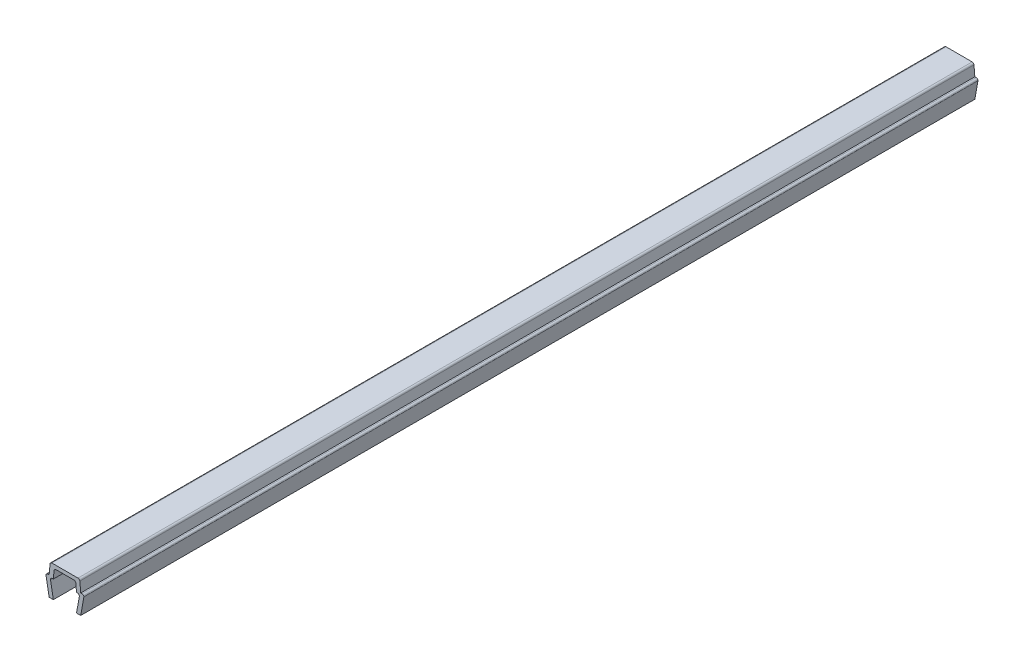
ISO-10303-21;
HEADER;
FILE_DESCRIPTION(('STEP AP214'),'2;1');
FILE_NAME('part.step','',(''),(''),'','','');
FILE_SCHEMA(('AUTOMOTIVE_DESIGN { 1 0 10303 214 1 1 1 1 }'));
ENDSEC;
DATA;
#1=APPLICATION_CONTEXT('core data for automotive mechanical design processes');
#2=APPLICATION_PROTOCOL_DEFINITION('international standard','automotive_design',2000,#1);
#3=PRODUCT_CONTEXT('',#1,'mechanical');
#4=PRODUCT('Part','Part','',(#3));
#5=PRODUCT_RELATED_PRODUCT_CATEGORY('part','',(#4));
#6=PRODUCT_DEFINITION_FORMATION('','',#4);
#7=PRODUCT_DEFINITION_CONTEXT('part definition',#1,'design');
#8=PRODUCT_DEFINITION('design','',#6,#7);
#9=PRODUCT_DEFINITION_SHAPE('','',#8);
#10=(LENGTH_UNIT() NAMED_UNIT(*) SI_UNIT(.MILLI.,.METRE.));
#11=(NAMED_UNIT(*) PLANE_ANGLE_UNIT() SI_UNIT($,.RADIAN.));
#12=(NAMED_UNIT(*) SI_UNIT($,.STERADIAN.) SOLID_ANGLE_UNIT());
#13=UNCERTAINTY_MEASURE_WITH_UNIT(LENGTH_MEASURE(1.E-05),#10,'distance_accuracy_value','');
#14=(GEOMETRIC_REPRESENTATION_CONTEXT(3) GLOBAL_UNCERTAINTY_ASSIGNED_CONTEXT((#13)) GLOBAL_UNIT_ASSIGNED_CONTEXT((#10,
#11,#12)) REPRESENTATION_CONTEXT('',''));
#15=CARTESIAN_POINT('',(0.,0.,0.));
#16=DIRECTION('',(0.,0.,1.));
#17=DIRECTION('',(1.,0.,0.));
#18=AXIS2_PLACEMENT_3D('',#15,#16,#17);
#19=CARTESIAN_POINT('',(-3.25000000000003,3.35000000000003,85.));
#20=DIRECTION('',(0.,0.,-1.));
#21=DIRECTION('',(-1.,0.,0.));
#22=AXIS2_PLACEMENT_3D('',#19,#20,#21);
#23=CYLINDRICAL_SURFACE('',#22,0.349999999999972);
#24=DIRECTION('',(0.,0.,-1.));
#25=VECTOR('',#24,1.);
#26=CARTESIAN_POINT('',(-3.25,3.7,85.));
#27=LINE('',#26,#25);
#28=CARTESIAN_POINT('',(-3.25,3.7,85.));
#29=VERTEX_POINT('',#28);
#30=CARTESIAN_POINT('',(-3.25,3.7,-85.));
#31=VERTEX_POINT('',#30);
#32=EDGE_CURVE('E211',#29,#31,#27,.T.);
#33=ORIENTED_EDGE('',*,*,#32,.T.);
#34=CARTESIAN_POINT('',(-3.25000000000003,3.35000000000003,-85.));
#35=DIRECTION('',(0.,0.,1.));
#36=DIRECTION('',(1.,0.,0.));
#37=AXIS2_PLACEMENT_3D('',#34,#35,#36);
#38=CIRCLE('',#37,0.349999999999972);
#39=CARTESIAN_POINT('',(-3.6,3.35,-85.));
#40=VERTEX_POINT('',#39);
#41=EDGE_CURVE('E205',#31,#40,#38,.T.);
#42=ORIENTED_EDGE('',*,*,#41,.T.);
#43=DIRECTION('',(0.,0.,-1.));
#44=VECTOR('',#43,1.);
#45=CARTESIAN_POINT('',(-3.6,3.35,85.));
#46=LINE('',#45,#44);
#47=CARTESIAN_POINT('',(-3.6,3.35,85.));
#48=VERTEX_POINT('',#47);
#49=EDGE_CURVE('E11',#48,#40,#46,.T.);
#50=ORIENTED_EDGE('',*,*,#49,.F.);
#51=CARTESIAN_POINT('',(-3.25000000000003,3.35000000000003,85.));
#52=DIRECTION('',(0.,0.,1.));
#53=DIRECTION('',(1.,0.,0.));
#54=AXIS2_PLACEMENT_3D('',#51,#52,#53);
#55=CIRCLE('',#54,0.349999999999972);
#56=EDGE_CURVE('E277',#29,#48,#55,.T.);
#57=ORIENTED_EDGE('',*,*,#56,.F.);
#58=EDGE_LOOP('',(#33,#42,#50,#57));
#59=FACE_BOUND('',#58,.T.);
#60=ADVANCED_FACE('F33',(#59),#23,.T.);
#61=CARTESIAN_POINT('',(-3.6,3.35,85.));
#62=DIRECTION('',(0.984336643247304,0.176299100283099,0.));
#63=DIRECTION('',(-0.176299100283099,0.984336643247304,0.));
#64=AXIS2_PLACEMENT_3D('',#61,#62,#63);
#65=PLANE('',#64);
#66=ORIENTED_EDGE('',*,*,#49,.T.);
#67=DIRECTION('',(0.176299100283099,-0.984336643247304,0.));
#68=VECTOR('',#67,1.);
#69=CARTESIAN_POINT('',(-3.6,3.35,-85.));
#70=LINE('',#69,#68);
#71=CARTESIAN_POINT('',(-3.,0.,-85.));
#72=VERTEX_POINT('',#71);
#73=EDGE_CURVE('E195',#40,#72,#70,.T.);
#74=ORIENTED_EDGE('',*,*,#73,.T.);
#75=DIRECTION('',(0.,0.,-1.));
#76=VECTOR('',#75,1.);
#77=CARTESIAN_POINT('',(-3.,0.,85.));
#78=LINE('',#77,#76);
#79=CARTESIAN_POINT('',(-3.,0.,85.));
#80=VERTEX_POINT('',#79);
#81=EDGE_CURVE('E40',#80,#72,#78,.T.);
#82=ORIENTED_EDGE('',*,*,#81,.F.);
#83=DIRECTION('',(0.176299100283099,-0.984336643247304,0.));
#84=VECTOR('',#83,1.);
#85=CARTESIAN_POINT('',(-3.6,3.35,85.));
#86=LINE('',#85,#84);
#87=EDGE_CURVE('E196',#48,#80,#86,.T.);
#88=ORIENTED_EDGE('',*,*,#87,.F.);
#89=EDGE_LOOP('',(#66,#74,#82,#88));
#90=FACE_BOUND('',#89,.T.);
#91=ADVANCED_FACE('F193',(#90),#65,.F.);
#92=CARTESIAN_POINT('',(-3.,0.,85.));
#93=DIRECTION('',(0.,1.,0.));
#94=DIRECTION('',(0.,0.,1.));
#95=AXIS2_PLACEMENT_3D('',#92,#93,#94);
#96=PLANE('',#95);
#97=ORIENTED_EDGE('',*,*,#81,.T.);
#98=DIRECTION('',(1.,0.,0.));
#99=VECTOR('',#98,1.);
#100=CARTESIAN_POINT('',(-3.,0.,-85.));
#101=LINE('',#100,#99);
#102=CARTESIAN_POINT('',(-2.2,0.,-85.));
#103=VERTEX_POINT('',#102);
#104=EDGE_CURVE('E209',#72,#103,#101,.T.);
#105=ORIENTED_EDGE('',*,*,#104,.T.);
#106=DIRECTION('',(0.,0.,-1.));
#107=VECTOR('',#106,1.);
#108=CARTESIAN_POINT('',(-2.2,0.,85.));
#109=LINE('',#108,#107);
#110=CARTESIAN_POINT('',(-2.2,0.,85.));
#111=VERTEX_POINT('',#110);
#112=EDGE_CURVE('E363',#111,#103,#109,.T.);
#113=ORIENTED_EDGE('',*,*,#112,.F.);
#114=DIRECTION('',(1.,0.,0.));
#115=VECTOR('',#114,1.);
#116=CARTESIAN_POINT('',(-3.,0.,85.));
#117=LINE('',#116,#115);
#118=EDGE_CURVE('E280',#80,#111,#117,.T.);
#119=ORIENTED_EDGE('',*,*,#118,.F.);
#120=EDGE_LOOP('',(#97,#105,#113,#119));
#121=FACE_BOUND('',#120,.T.);
#122=ADVANCED_FACE('F366',(#121),#96,.F.);
#123=CARTESIAN_POINT('',(-2.2,0.,85.));
#124=DIRECTION('',(-0.984336643247306,-0.176299100283088,0.));
#125=DIRECTION('',(0.176299100283088,-0.984336643247306,0.));
#126=AXIS2_PLACEMENT_3D('',#123,#124,#125);
#127=PLANE('',#126);
#128=ORIENTED_EDGE('',*,*,#112,.T.);
#129=DIRECTION('',(-0.176299100283088,0.984336643247306,0.));
#130=VECTOR('',#129,1.);
#131=CARTESIAN_POINT('',(-2.2,0.,-85.));
#132=LINE('',#131,#130);
#133=CARTESIAN_POINT('',(-2.7352170713255,2.9882953149009,-85.));
#134=VERTEX_POINT('',#133);
#135=EDGE_CURVE('E215',#103,#134,#132,.T.);
#136=ORIENTED_EDGE('',*,*,#135,.T.);
#137=DIRECTION('',(0.,0.,-1.));
#138=VECTOR('',#137,1.);
#139=CARTESIAN_POINT('',(-2.7352170713255,2.9882953149009,85.));
#140=LINE('',#139,#138);
#141=CARTESIAN_POINT('',(-2.7352170713255,2.9882953149009,85.));
#142=VERTEX_POINT('',#141);
#143=EDGE_CURVE('E361',#142,#134,#140,.T.);
#144=ORIENTED_EDGE('',*,*,#143,.F.);
#145=DIRECTION('',(-0.176299100283088,0.984336643247306,0.));
#146=VECTOR('',#145,1.);
#147=CARTESIAN_POINT('',(-2.2,0.,85.));
#148=LINE('',#147,#146);
#149=EDGE_CURVE('E282',#111,#142,#148,.T.);
#150=ORIENTED_EDGE('',*,*,#149,.F.);
#151=EDGE_LOOP('',(#128,#136,#144,#150));
#152=FACE_BOUND('',#151,.T.);
#153=ADVANCED_FACE('F374',(#152),#127,.F.);
#154=CARTESIAN_POINT('',(-2.390699246189,3.05000000000004,85.));
#155=DIRECTION('',(0.,0.,-1.));
#156=DIRECTION('',(-1.,0.,0.));
#157=AXIS2_PLACEMENT_3D('',#154,#155,#156);
#158=CYLINDRICAL_SURFACE('',#157,0.349999999999955);
#159=ORIENTED_EDGE('',*,*,#143,.T.);
#160=CARTESIAN_POINT('',(-2.390699246189,3.05000000000004,-85.));
#161=DIRECTION('',(0.,0.,-1.));
#162=DIRECTION('',(-1.,0.,0.));
#163=AXIS2_PLACEMENT_3D('',#160,#161,#162);
#164=CIRCLE('',#163,0.349999999999955);
#165=CARTESIAN_POINT('',(-2.390699246189,3.4,-85.));
#166=VERTEX_POINT('',#165);
#167=EDGE_CURVE('E218',#134,#166,#164,.T.);
#168=ORIENTED_EDGE('',*,*,#167,.T.);
#169=DIRECTION('',(0.,0.,-1.));
#170=VECTOR('',#169,1.);
#171=CARTESIAN_POINT('',(-2.390699246189,3.4,85.));
#172=LINE('',#171,#170);
#173=CARTESIAN_POINT('',(-2.390699246189,3.4,85.));
#174=VERTEX_POINT('',#173);
#175=EDGE_CURVE('E359',#174,#166,#172,.T.);
#176=ORIENTED_EDGE('',*,*,#175,.F.);
#177=CARTESIAN_POINT('',(-2.390699246189,3.05000000000004,85.));
#178=DIRECTION('',(0.,0.,-1.));
#179=DIRECTION('',(-1.,0.,0.));
#180=AXIS2_PLACEMENT_3D('',#177,#178,#179);
#181=CIRCLE('',#180,0.349999999999955);
#182=EDGE_CURVE('E284',#142,#174,#181,.T.);
#183=ORIENTED_EDGE('',*,*,#182,.F.);
#184=EDGE_LOOP('',(#159,#168,#176,#183));
#185=FACE_BOUND('',#184,.T.);
#186=ADVANCED_FACE('F377',(#185),#158,.F.);
#187=CARTESIAN_POINT('',(-2.390699246189,3.4,85.));
#188=DIRECTION('',(0.,1.,0.));
#189=DIRECTION('',(0.,0.,1.));
#190=AXIS2_PLACEMENT_3D('',#187,#188,#189);
#191=PLANE('',#190);
#192=ORIENTED_EDGE('',*,*,#175,.T.);
#193=DIRECTION('',(1.,0.,0.));
#194=VECTOR('',#193,1.);
#195=CARTESIAN_POINT('',(-2.390699246189,3.4,-85.));
#196=LINE('',#195,#194);
#197=CARTESIAN_POINT('',(-2.2,3.4,-85.));
#198=VERTEX_POINT('',#197);
#199=EDGE_CURVE('E221',#166,#198,#196,.T.);
#200=ORIENTED_EDGE('',*,*,#199,.T.);
#201=DIRECTION('',(0.,0.,-1.));
#202=VECTOR('',#201,1.);
#203=CARTESIAN_POINT('',(-2.2,3.4,85.));
#204=LINE('',#203,#202);
#205=CARTESIAN_POINT('',(-2.2,3.4,85.));
#206=VERTEX_POINT('',#205);
#207=EDGE_CURVE('E357',#206,#198,#204,.T.);
#208=ORIENTED_EDGE('',*,*,#207,.F.);
#209=DIRECTION('',(1.,0.,0.));
#210=VECTOR('',#209,1.);
#211=CARTESIAN_POINT('',(-2.390699246189,3.4,85.));
#212=LINE('',#211,#210);
#213=EDGE_CURVE('E286',#174,#206,#212,.T.);
#214=ORIENTED_EDGE('',*,*,#213,.F.);
#215=EDGE_LOOP('',(#192,#200,#208,#214));
#216=FACE_BOUND('',#215,.T.);
#217=ADVANCED_FACE('F382',(#216),#191,.F.);
#218=CARTESIAN_POINT('',(-2.2,3.4,85.));
#219=DIRECTION('',(-0.996194698091743,0.08715574274769,0.));
#220=DIRECTION('',(-0.08715574274769,-0.996194698091743,0.));
#221=AXIS2_PLACEMENT_3D('',#218,#219,#220);
#222=PLANE('',#221);
#223=ORIENTED_EDGE('',*,*,#207,.T.);
#224=DIRECTION('',(0.08715574274769,0.996194698091743,0.));
#225=VECTOR('',#224,1.);
#226=CARTESIAN_POINT('',(-2.2,3.4,-85.));
#227=LINE('',#226,#225);
#228=CARTESIAN_POINT('',(-2.0704726390793,4.8805045099617,-85.));
#229=VERTEX_POINT('',#228);
#230=EDGE_CURVE('E224',#198,#229,#227,.T.);
#231=ORIENTED_EDGE('',*,*,#230,.T.);
#232=DIRECTION('',(0.,0.,-1.));
#233=VECTOR('',#232,1.);
#234=CARTESIAN_POINT('',(-2.0704726390793,4.8805045099617,85.));
#235=LINE('',#234,#233);
#236=CARTESIAN_POINT('',(-2.0704726390793,4.8805045099617,85.));
#237=VERTEX_POINT('',#236);
#238=EDGE_CURVE('E355',#237,#229,#235,.T.);
#239=ORIENTED_EDGE('',*,*,#238,.F.);
#240=DIRECTION('',(0.08715574274769,0.996194698091743,0.));
#241=VECTOR('',#240,1.);
#242=CARTESIAN_POINT('',(-2.2,3.4,85.));
#243=LINE('',#242,#241);
#244=EDGE_CURVE('E288',#206,#237,#243,.T.);
#245=ORIENTED_EDGE('',*,*,#244,.F.);
#246=EDGE_LOOP('',(#223,#231,#239,#245));
#247=FACE_BOUND('',#246,.T.);
#248=ADVANCED_FACE('F388',(#247),#222,.F.);
#249=CARTESIAN_POINT('',(-1.72180449474716,4.84999999999996,85.));
#250=DIRECTION('',(0.,0.,-1.));
#251=DIRECTION('',(-1.,0.,0.));
#252=AXIS2_PLACEMENT_3D('',#249,#250,#251);
#253=CYLINDRICAL_SURFACE('',#252,0.350000000000036);
#254=ORIENTED_EDGE('',*,*,#238,.T.);
#255=CARTESIAN_POINT('',(-1.72180449474716,4.84999999999996,-85.));
#256=DIRECTION('',(0.,0.,-1.));
#257=DIRECTION('',(-1.,0.,0.));
#258=AXIS2_PLACEMENT_3D('',#255,#256,#257);
#259=CIRCLE('',#258,0.350000000000036);
#260=CARTESIAN_POINT('',(-1.7218044947472,5.2,-85.));
#261=VERTEX_POINT('',#260);
#262=EDGE_CURVE('E227',#229,#261,#259,.T.);
#263=ORIENTED_EDGE('',*,*,#262,.T.);
#264=DIRECTION('',(0.,0.,-1.));
#265=VECTOR('',#264,1.);
#266=CARTESIAN_POINT('',(-1.7218044947472,5.2,85.));
#267=LINE('',#266,#265);
#268=CARTESIAN_POINT('',(-1.7218044947472,5.2,85.));
#269=VERTEX_POINT('',#268);
#270=EDGE_CURVE('E353',#269,#261,#267,.T.);
#271=ORIENTED_EDGE('',*,*,#270,.F.);
#272=CARTESIAN_POINT('',(-1.72180449474716,4.84999999999996,85.));
#273=DIRECTION('',(0.,0.,-1.));
#274=DIRECTION('',(-1.,0.,0.));
#275=AXIS2_PLACEMENT_3D('',#272,#273,#274);
#276=CIRCLE('',#275,0.350000000000036);
#277=EDGE_CURVE('E290',#237,#269,#276,.T.);
#278=ORIENTED_EDGE('',*,*,#277,.F.);
#279=EDGE_LOOP('',(#254,#263,#271,#278));
#280=FACE_BOUND('',#279,.T.);
#281=ADVANCED_FACE('F392',(#280),#253,.F.);
#282=CARTESIAN_POINT('',(-1.7218044947472,5.2,85.));
#283=DIRECTION('',(0.,1.,0.));
#284=DIRECTION('',(0.,0.,1.));
#285=AXIS2_PLACEMENT_3D('',#282,#283,#284);
#286=PLANE('',#285);
#287=ORIENTED_EDGE('',*,*,#270,.T.);
#288=DIRECTION('',(1.,0.,0.));
#289=VECTOR('',#288,1.);
#290=CARTESIAN_POINT('',(-1.7218044947472,5.2,-85.));
#291=LINE('',#290,#289);
#292=CARTESIAN_POINT('',(1.7218044947472,5.2,-85.));
#293=VERTEX_POINT('',#292);
#294=EDGE_CURVE('E230',#261,#293,#291,.T.);
#295=ORIENTED_EDGE('',*,*,#294,.T.);
#296=DIRECTION('',(0.,0.,-1.));
#297=VECTOR('',#296,1.);
#298=CARTESIAN_POINT('',(1.7218044947472,5.2,85.));
#299=LINE('',#298,#297);
#300=CARTESIAN_POINT('',(1.7218044947472,5.2,85.));
#301=VERTEX_POINT('',#300);
#302=EDGE_CURVE('E351',#301,#293,#299,.T.);
#303=ORIENTED_EDGE('',*,*,#302,.F.);
#304=DIRECTION('',(1.,0.,0.));
#305=VECTOR('',#304,1.);
#306=CARTESIAN_POINT('',(-1.7218044947472,5.2,85.));
#307=LINE('',#306,#305);
#308=EDGE_CURVE('E292',#269,#301,#307,.T.);
#309=ORIENTED_EDGE('',*,*,#308,.F.);
#310=EDGE_LOOP('',(#287,#295,#303,#309));
#311=FACE_BOUND('',#310,.T.);
#312=ADVANCED_FACE('F397',(#311),#286,.F.);
#313=CARTESIAN_POINT('',(1.72180449474716,4.84999999999996,85.));
#314=DIRECTION('',(0.,0.,-1.));
#315=DIRECTION('',(-1.,0.,0.));
#316=AXIS2_PLACEMENT_3D('',#313,#314,#315);
#317=CYLINDRICAL_SURFACE('',#316,0.350000000000036);
#318=ORIENTED_EDGE('',*,*,#302,.T.);
#319=CARTESIAN_POINT('',(1.72180449474716,4.84999999999996,-85.));
#320=DIRECTION('',(0.,0.,-1.));
#321=DIRECTION('',(-1.,0.,0.));
#322=AXIS2_PLACEMENT_3D('',#319,#320,#321);
#323=CIRCLE('',#322,0.350000000000036);
#324=CARTESIAN_POINT('',(2.0704726390793,4.8805045099617,-85.));
#325=VERTEX_POINT('',#324);
#326=EDGE_CURVE('E233',#293,#325,#323,.T.);
#327=ORIENTED_EDGE('',*,*,#326,.T.);
#328=DIRECTION('',(0.,0.,-1.));
#329=VECTOR('',#328,1.);
#330=CARTESIAN_POINT('',(2.0704726390793,4.8805045099617,85.));
#331=LINE('',#330,#329);
#332=CARTESIAN_POINT('',(2.0704726390793,4.8805045099617,85.));
#333=VERTEX_POINT('',#332);
#334=EDGE_CURVE('E349',#333,#325,#331,.T.);
#335=ORIENTED_EDGE('',*,*,#334,.F.);
#336=CARTESIAN_POINT('',(1.72180449474716,4.84999999999996,85.));
#337=DIRECTION('',(0.,0.,-1.));
#338=DIRECTION('',(-1.,0.,0.));
#339=AXIS2_PLACEMENT_3D('',#336,#337,#338);
#340=CIRCLE('',#339,0.350000000000036);
#341=EDGE_CURVE('E294',#301,#333,#340,.T.);
#342=ORIENTED_EDGE('',*,*,#341,.F.);
#343=EDGE_LOOP('',(#318,#327,#335,#342));
#344=FACE_BOUND('',#343,.T.);
#345=ADVANCED_FACE('F403',(#344),#317,.F.);
#346=CARTESIAN_POINT('',(2.0704726390793,4.8805045099617,85.));
#347=DIRECTION('',(0.996194698091743,0.08715574274769,0.));
#348=DIRECTION('',(-0.08715574274769,0.996194698091743,0.));
#349=AXIS2_PLACEMENT_3D('',#346,#347,#348);
#350=PLANE('',#349);
#351=ORIENTED_EDGE('',*,*,#334,.T.);
#352=DIRECTION('',(0.08715574274769,-0.996194698091743,0.));
#353=VECTOR('',#352,1.);
#354=CARTESIAN_POINT('',(2.0704726390793,4.8805045099617,-85.));
#355=LINE('',#354,#353);
#356=CARTESIAN_POINT('',(2.2,3.4,-85.));
#357=VERTEX_POINT('',#356);
#358=EDGE_CURVE('E236',#325,#357,#355,.T.);
#359=ORIENTED_EDGE('',*,*,#358,.T.);
#360=DIRECTION('',(0.,0.,-1.));
#361=VECTOR('',#360,1.);
#362=CARTESIAN_POINT('',(2.2,3.4,85.));
#363=LINE('',#362,#361);
#364=CARTESIAN_POINT('',(2.2,3.4,85.));
#365=VERTEX_POINT('',#364);
#366=EDGE_CURVE('E347',#365,#357,#363,.T.);
#367=ORIENTED_EDGE('',*,*,#366,.F.);
#368=DIRECTION('',(0.08715574274769,-0.996194698091743,0.));
#369=VECTOR('',#368,1.);
#370=CARTESIAN_POINT('',(2.0704726390793,4.8805045099617,85.));
#371=LINE('',#370,#369);
#372=EDGE_CURVE('E296',#333,#365,#371,.T.);
#373=ORIENTED_EDGE('',*,*,#372,.F.);
#374=EDGE_LOOP('',(#351,#359,#367,#373));
#375=FACE_BOUND('',#374,.T.);
#376=ADVANCED_FACE('F407',(#375),#350,.F.);
#377=CARTESIAN_POINT('',(2.2,3.4,85.));
#378=DIRECTION('',(0.,1.,0.));
#379=DIRECTION('',(0.,0.,1.));
#380=AXIS2_PLACEMENT_3D('',#377,#378,#379);
#381=PLANE('',#380);
#382=ORIENTED_EDGE('',*,*,#366,.T.);
#383=DIRECTION('',(1.,0.,0.));
#384=VECTOR('',#383,1.);
#385=CARTESIAN_POINT('',(2.2,3.4,-85.));
#386=LINE('',#385,#384);
#387=CARTESIAN_POINT('',(2.390699246189,3.4,-85.));
#388=VERTEX_POINT('',#387);
#389=EDGE_CURVE('E239',#357,#388,#386,.T.);
#390=ORIENTED_EDGE('',*,*,#389,.T.);
#391=DIRECTION('',(0.,0.,-1.));
#392=VECTOR('',#391,1.);
#393=CARTESIAN_POINT('',(2.390699246189,3.4,85.));
#394=LINE('',#393,#392);
#395=CARTESIAN_POINT('',(2.390699246189,3.4,85.));
#396=VERTEX_POINT('',#395);
#397=EDGE_CURVE('E345',#396,#388,#394,.T.);
#398=ORIENTED_EDGE('',*,*,#397,.F.);
#399=DIRECTION('',(1.,0.,0.));
#400=VECTOR('',#399,1.);
#401=CARTESIAN_POINT('',(2.2,3.4,85.));
#402=LINE('',#401,#400);
#403=EDGE_CURVE('E298',#365,#396,#402,.T.);
#404=ORIENTED_EDGE('',*,*,#403,.F.);
#405=EDGE_LOOP('',(#382,#390,#398,#404));
#406=FACE_BOUND('',#405,.T.);
#407=ADVANCED_FACE('F412',(#406),#381,.F.);
#408=CARTESIAN_POINT('',(2.390699246189,3.05000000000004,85.));
#409=DIRECTION('',(0.,0.,-1.));
#410=DIRECTION('',(-1.,0.,0.));
#411=AXIS2_PLACEMENT_3D('',#408,#409,#410);
#412=CYLINDRICAL_SURFACE('',#411,0.349999999999955);
#413=ORIENTED_EDGE('',*,*,#397,.T.);
#414=CARTESIAN_POINT('',(2.390699246189,3.05000000000004,-85.));
#415=DIRECTION('',(0.,0.,-1.));
#416=DIRECTION('',(-1.,0.,0.));
#417=AXIS2_PLACEMENT_3D('',#414,#415,#416);
#418=CIRCLE('',#417,0.349999999999955);
#419=CARTESIAN_POINT('',(2.7352170713255,2.9882953149009,-85.));
#420=VERTEX_POINT('',#419);
#421=EDGE_CURVE('E242',#388,#420,#418,.T.);
#422=ORIENTED_EDGE('',*,*,#421,.T.);
#423=DIRECTION('',(0.,0.,-1.));
#424=VECTOR('',#423,1.);
#425=CARTESIAN_POINT('',(2.7352170713255,2.9882953149009,85.));
#426=LINE('',#425,#424);
#427=CARTESIAN_POINT('',(2.7352170713255,2.9882953149009,85.));
#428=VERTEX_POINT('',#427);
#429=EDGE_CURVE('E343',#428,#420,#426,.T.);
#430=ORIENTED_EDGE('',*,*,#429,.F.);
#431=CARTESIAN_POINT('',(2.390699246189,3.05000000000004,85.));
#432=DIRECTION('',(0.,0.,-1.));
#433=DIRECTION('',(-1.,0.,0.));
#434=AXIS2_PLACEMENT_3D('',#431,#432,#433);
#435=CIRCLE('',#434,0.349999999999955);
#436=EDGE_CURVE('E300',#396,#428,#435,.T.);
#437=ORIENTED_EDGE('',*,*,#436,.F.);
#438=EDGE_LOOP('',(#413,#422,#430,#437));
#439=FACE_BOUND('',#438,.T.);
#440=ADVANCED_FACE('F418',(#439),#412,.F.);
#441=CARTESIAN_POINT('',(2.7352170713255,2.9882953149009,85.));
#442=DIRECTION('',(0.984336643247306,-0.176299100283088,0.));
#443=DIRECTION('',(0.176299100283088,0.984336643247306,0.));
#444=AXIS2_PLACEMENT_3D('',#441,#442,#443);
#445=PLANE('',#444);
#446=ORIENTED_EDGE('',*,*,#429,.T.);
#447=DIRECTION('',(-0.176299100283088,-0.984336643247306,0.));
#448=VECTOR('',#447,1.);
#449=CARTESIAN_POINT('',(2.7352170713255,2.9882953149009,-85.));
#450=LINE('',#449,#448);
#451=CARTESIAN_POINT('',(2.2,0.,-85.));
#452=VERTEX_POINT('',#451);
#453=EDGE_CURVE('E245',#420,#452,#450,.T.);
#454=ORIENTED_EDGE('',*,*,#453,.T.);
#455=DIRECTION('',(0.,0.,-1.));
#456=VECTOR('',#455,1.);
#457=CARTESIAN_POINT('',(2.2,0.,85.));
#458=LINE('',#457,#456);
#459=CARTESIAN_POINT('',(2.2,0.,85.));
#460=VERTEX_POINT('',#459);
#461=EDGE_CURVE('E341',#460,#452,#458,.T.);
#462=ORIENTED_EDGE('',*,*,#461,.F.);
#463=DIRECTION('',(-0.176299100283088,-0.984336643247306,0.));
#464=VECTOR('',#463,1.);
#465=CARTESIAN_POINT('',(2.7352170713255,2.9882953149009,85.));
#466=LINE('',#465,#464);
#467=EDGE_CURVE('E302',#428,#460,#466,.T.);
#468=ORIENTED_EDGE('',*,*,#467,.F.);
#469=EDGE_LOOP('',(#446,#454,#462,#468));
#470=FACE_BOUND('',#469,.T.);
#471=ADVANCED_FACE('F422',(#470),#445,.F.);
#472=CARTESIAN_POINT('',(2.2,0.,85.));
#473=DIRECTION('',(0.,1.,0.));
#474=DIRECTION('',(0.,0.,1.));
#475=AXIS2_PLACEMENT_3D('',#472,#473,#474);
#476=PLANE('',#475);
#477=ORIENTED_EDGE('',*,*,#461,.T.);
#478=DIRECTION('',(1.,0.,0.));
#479=VECTOR('',#478,1.);
#480=CARTESIAN_POINT('',(2.2,0.,-85.));
#481=LINE('',#480,#479);
#482=CARTESIAN_POINT('',(3.,0.,-85.));
#483=VERTEX_POINT('',#482);
#484=EDGE_CURVE('E248',#452,#483,#481,.T.);
#485=ORIENTED_EDGE('',*,*,#484,.T.);
#486=DIRECTION('',(0.,0.,-1.));
#487=VECTOR('',#486,1.);
#488=CARTESIAN_POINT('',(3.,0.,85.));
#489=LINE('',#488,#487);
#490=CARTESIAN_POINT('',(3.,0.,85.));
#491=VERTEX_POINT('',#490);
#492=EDGE_CURVE('E339',#491,#483,#489,.T.);
#493=ORIENTED_EDGE('',*,*,#492,.F.);
#494=DIRECTION('',(1.,0.,0.));
#495=VECTOR('',#494,1.);
#496=CARTESIAN_POINT('',(2.2,0.,85.));
#497=LINE('',#496,#495);
#498=EDGE_CURVE('E304',#460,#491,#497,.T.);
#499=ORIENTED_EDGE('',*,*,#498,.F.);
#500=EDGE_LOOP('',(#477,#485,#493,#499));
#501=FACE_BOUND('',#500,.T.);
#502=ADVANCED_FACE('F427',(#501),#476,.F.);
#503=CARTESIAN_POINT('',(3.,0.,85.));
#504=DIRECTION('',(-0.984336643247304,0.176299100283099,0.));
#505=DIRECTION('',(-0.176299100283099,-0.984336643247304,0.));
#506=AXIS2_PLACEMENT_3D('',#503,#504,#505);
#507=PLANE('',#506);
#508=ORIENTED_EDGE('',*,*,#492,.T.);
#509=DIRECTION('',(0.176299100283099,0.984336643247304,0.));
#510=VECTOR('',#509,1.);
#511=CARTESIAN_POINT('',(3.,0.,-85.));
#512=LINE('',#511,#510);
#513=CARTESIAN_POINT('',(3.6,3.35,-85.));
#514=VERTEX_POINT('',#513);
#515=EDGE_CURVE('E251',#483,#514,#512,.T.);
#516=ORIENTED_EDGE('',*,*,#515,.T.);
#517=DIRECTION('',(0.,0.,-1.));
#518=VECTOR('',#517,1.);
#519=CARTESIAN_POINT('',(3.6,3.35,85.));
#520=LINE('',#519,#518);
#521=CARTESIAN_POINT('',(3.6,3.35,85.));
#522=VERTEX_POINT('',#521);
#523=EDGE_CURVE('E337',#522,#514,#520,.T.);
#524=ORIENTED_EDGE('',*,*,#523,.F.);
#525=DIRECTION('',(0.176299100283099,0.984336643247304,0.));
#526=VECTOR('',#525,1.);
#527=CARTESIAN_POINT('',(3.,0.,85.));
#528=LINE('',#527,#526);
#529=EDGE_CURVE('E306',#491,#522,#528,.T.);
#530=ORIENTED_EDGE('',*,*,#529,.F.);
#531=EDGE_LOOP('',(#508,#516,#524,#530));
#532=FACE_BOUND('',#531,.T.);
#533=ADVANCED_FACE('F433',(#532),#507,.F.);
#534=CARTESIAN_POINT('',(3.25000000000003,3.35000000000003,85.));
#535=DIRECTION('',(0.,0.,-1.));
#536=DIRECTION('',(-1.,0.,0.));
#537=AXIS2_PLACEMENT_3D('',#534,#535,#536);
#538=CYLINDRICAL_SURFACE('',#537,0.349999999999972);
#539=ORIENTED_EDGE('',*,*,#523,.T.);
#540=CARTESIAN_POINT('',(3.25000000000003,3.35000000000003,-85.));
#541=DIRECTION('',(0.,0.,1.));
#542=DIRECTION('',(1.,0.,0.));
#543=AXIS2_PLACEMENT_3D('',#540,#541,#542);
#544=CIRCLE('',#543,0.349999999999972);
#545=CARTESIAN_POINT('',(3.25,3.7,-85.));
#546=VERTEX_POINT('',#545);
#547=EDGE_CURVE('E254',#514,#546,#544,.T.);
#548=ORIENTED_EDGE('',*,*,#547,.T.);
#549=DIRECTION('',(0.,0.,-1.));
#550=VECTOR('',#549,1.);
#551=CARTESIAN_POINT('',(3.25,3.7,85.));
#552=LINE('',#551,#550);
#553=CARTESIAN_POINT('',(3.25,3.7,85.));
#554=VERTEX_POINT('',#553);
#555=EDGE_CURVE('E335',#554,#546,#552,.T.);
#556=ORIENTED_EDGE('',*,*,#555,.F.);
#557=CARTESIAN_POINT('',(3.25000000000003,3.35000000000003,85.));
#558=DIRECTION('',(0.,0.,1.));
#559=DIRECTION('',(1.,0.,0.));
#560=AXIS2_PLACEMENT_3D('',#557,#558,#559);
#561=CIRCLE('',#560,0.349999999999972);
#562=EDGE_CURVE('E308',#522,#554,#561,.T.);
#563=ORIENTED_EDGE('',*,*,#562,.F.);
#564=EDGE_LOOP('',(#539,#548,#556,#563));
#565=FACE_BOUND('',#564,.T.);
#566=ADVANCED_FACE('F437',(#565),#538,.T.);
#567=CARTESIAN_POINT('',(3.25,3.7,85.));
#568=DIRECTION('',(0.,-1.,0.));
#569=DIRECTION('',(0.,0.,-1.));
#570=AXIS2_PLACEMENT_3D('',#567,#568,#569);
#571=PLANE('',#570);
#572=ORIENTED_EDGE('',*,*,#555,.T.);
#573=DIRECTION('',(-1.,0.,0.));
#574=VECTOR('',#573,1.);
#575=CARTESIAN_POINT('',(3.25,3.7,-85.));
#576=LINE('',#575,#574);
#577=CARTESIAN_POINT('',(3.,3.7,-85.));
#578=VERTEX_POINT('',#577);
#579=EDGE_CURVE('E257',#546,#578,#576,.T.);
#580=ORIENTED_EDGE('',*,*,#579,.T.);
#581=DIRECTION('',(0.,0.,-1.));
#582=VECTOR('',#581,1.);
#583=CARTESIAN_POINT('',(3.,3.7,85.));
#584=LINE('',#583,#582);
#585=CARTESIAN_POINT('',(3.,3.7,85.));
#586=VERTEX_POINT('',#585);
#587=EDGE_CURVE('E333',#586,#578,#584,.T.);
#588=ORIENTED_EDGE('',*,*,#587,.F.);
#589=DIRECTION('',(-1.,0.,0.));
#590=VECTOR('',#589,1.);
#591=CARTESIAN_POINT('',(3.25,3.7,85.));
#592=LINE('',#591,#590);
#593=EDGE_CURVE('E310',#554,#586,#592,.T.);
#594=ORIENTED_EDGE('',*,*,#593,.F.);
#595=EDGE_LOOP('',(#572,#580,#588,#594));
#596=FACE_BOUND('',#595,.T.);
#597=ADVANCED_FACE('F442',(#596),#571,.F.);
#598=CARTESIAN_POINT('',(3.,3.7,85.));
#599=DIRECTION('',(-0.996194698091747,-0.0871557427476467,0.));
#600=DIRECTION('',(0.0871557427476467,-0.996194698091747,0.));
#601=AXIS2_PLACEMENT_3D('',#598,#599,#600);
#602=PLANE('',#601);
#603=ORIENTED_EDGE('',*,*,#587,.T.);
#604=DIRECTION('',(-0.0871557427476467,0.996194698091747,0.));
#605=VECTOR('',#604,1.);
#606=CARTESIAN_POINT('',(3.,3.7,-85.));
#607=LINE('',#606,#605);
#608=CARTESIAN_POINT('',(2.835477173669,5.5805045099617,-85.));
#609=VERTEX_POINT('',#608);
#610=EDGE_CURVE('E260',#578,#609,#607,.T.);
#611=ORIENTED_EDGE('',*,*,#610,.T.);
#612=DIRECTION('',(0.,0.,-1.));
#613=VECTOR('',#612,1.);
#614=CARTESIAN_POINT('',(2.835477173669,5.5805045099617,85.));
#615=LINE('',#614,#613);
#616=CARTESIAN_POINT('',(2.835477173669,5.5805045099617,85.));
#617=VERTEX_POINT('',#616);
#618=EDGE_CURVE('E331',#617,#609,#615,.T.);
#619=ORIENTED_EDGE('',*,*,#618,.F.);
#620=DIRECTION('',(-0.0871557427476467,0.996194698091747,0.));
#621=VECTOR('',#620,1.);
#622=CARTESIAN_POINT('',(3.,3.7,85.));
#623=LINE('',#622,#621);
#624=EDGE_CURVE('E312',#586,#617,#623,.T.);
#625=ORIENTED_EDGE('',*,*,#624,.F.);
#626=EDGE_LOOP('',(#603,#611,#619,#625));
#627=FACE_BOUND('',#626,.T.);
#628=ADVANCED_FACE('F448',(#627),#602,.F.);
#629=CARTESIAN_POINT('',(2.48680902933686,5.54999999999996,85.));
#630=DIRECTION('',(0.,0.,-1.));
#631=DIRECTION('',(-1.,0.,0.));
#632=AXIS2_PLACEMENT_3D('',#629,#630,#631);
#633=CYLINDRICAL_SURFACE('',#632,0.350000000000036);
#634=ORIENTED_EDGE('',*,*,#618,.T.);
#635=CARTESIAN_POINT('',(2.48680902933686,5.54999999999996,-85.));
#636=DIRECTION('',(0.,0.,1.));
#637=DIRECTION('',(1.,0.,0.));
#638=AXIS2_PLACEMENT_3D('',#635,#636,#637);
#639=CIRCLE('',#638,0.350000000000036);
#640=CARTESIAN_POINT('',(2.4868090293369,5.9,-85.));
#641=VERTEX_POINT('',#640);
#642=EDGE_CURVE('E263',#609,#641,#639,.T.);
#643=ORIENTED_EDGE('',*,*,#642,.T.);
#644=DIRECTION('',(0.,0.,-1.));
#645=VECTOR('',#644,1.);
#646=CARTESIAN_POINT('',(2.4868090293369,5.9,85.));
#647=LINE('',#646,#645);
#648=CARTESIAN_POINT('',(2.4868090293369,5.9,85.));
#649=VERTEX_POINT('',#648);
#650=EDGE_CURVE('E329',#649,#641,#647,.T.);
#651=ORIENTED_EDGE('',*,*,#650,.F.);
#652=CARTESIAN_POINT('',(2.48680902933686,5.54999999999996,85.));
#653=DIRECTION('',(0.,0.,1.));
#654=DIRECTION('',(1.,0.,0.));
#655=AXIS2_PLACEMENT_3D('',#652,#653,#654);
#656=CIRCLE('',#655,0.350000000000036);
#657=EDGE_CURVE('E314',#617,#649,#656,.T.);
#658=ORIENTED_EDGE('',*,*,#657,.F.);
#659=EDGE_LOOP('',(#634,#643,#651,#658));
#660=FACE_BOUND('',#659,.T.);
#661=ADVANCED_FACE('F452',(#660),#633,.T.);
#662=CARTESIAN_POINT('',(2.4868090293369,5.9,85.));
#663=DIRECTION('',(0.,-1.,0.));
#664=DIRECTION('',(0.,0.,-1.));
#665=AXIS2_PLACEMENT_3D('',#662,#663,#664);
#666=PLANE('',#665);
#667=ORIENTED_EDGE('',*,*,#650,.T.);
#668=DIRECTION('',(-1.,0.,0.));
#669=VECTOR('',#668,1.);
#670=CARTESIAN_POINT('',(2.4868090293369,5.9,-85.));
#671=LINE('',#670,#669);
#672=CARTESIAN_POINT('',(-2.4868090293369,5.9,-85.));
#673=VERTEX_POINT('',#672);
#674=EDGE_CURVE('E266',#641,#673,#671,.T.);
#675=ORIENTED_EDGE('',*,*,#674,.T.);
#676=DIRECTION('',(0.,0.,-1.));
#677=VECTOR('',#676,1.);
#678=CARTESIAN_POINT('',(-2.4868090293369,5.9,85.));
#679=LINE('',#678,#677);
#680=CARTESIAN_POINT('',(-2.4868090293369,5.9,85.));
#681=VERTEX_POINT('',#680);
#682=EDGE_CURVE('E327',#681,#673,#679,.T.);
#683=ORIENTED_EDGE('',*,*,#682,.F.);
#684=DIRECTION('',(-1.,0.,0.));
#685=VECTOR('',#684,1.);
#686=CARTESIAN_POINT('',(2.4868090293369,5.9,85.));
#687=LINE('',#686,#685);
#688=EDGE_CURVE('E316',#649,#681,#687,.T.);
#689=ORIENTED_EDGE('',*,*,#688,.F.);
#690=EDGE_LOOP('',(#667,#675,#683,#689));
#691=FACE_BOUND('',#690,.T.);
#692=ADVANCED_FACE('F457',(#691),#666,.F.);
#693=CARTESIAN_POINT('',(-2.48680902933686,5.54999999999996,85.));
#694=DIRECTION('',(0.,0.,-1.));
#695=DIRECTION('',(-1.,0.,0.));
#696=AXIS2_PLACEMENT_3D('',#693,#694,#695);
#697=CYLINDRICAL_SURFACE('',#696,0.350000000000036);
#698=ORIENTED_EDGE('',*,*,#682,.T.);
#699=CARTESIAN_POINT('',(-2.48680902933686,5.54999999999996,-85.));
#700=DIRECTION('',(0.,0.,1.));
#701=DIRECTION('',(1.,0.,0.));
#702=AXIS2_PLACEMENT_3D('',#699,#700,#701);
#703=CIRCLE('',#702,0.350000000000036);
#704=CARTESIAN_POINT('',(-2.835477173669,5.5805045099617,-85.));
#705=VERTEX_POINT('',#704);
#706=EDGE_CURVE('E269',#673,#705,#703,.T.);
#707=ORIENTED_EDGE('',*,*,#706,.T.);
#708=DIRECTION('',(0.,0.,-1.));
#709=VECTOR('',#708,1.);
#710=CARTESIAN_POINT('',(-2.835477173669,5.5805045099617,85.));
#711=LINE('',#710,#709);
#712=CARTESIAN_POINT('',(-2.835477173669,5.5805045099617,85.));
#713=VERTEX_POINT('',#712);
#714=EDGE_CURVE('E325',#713,#705,#711,.T.);
#715=ORIENTED_EDGE('',*,*,#714,.F.);
#716=CARTESIAN_POINT('',(-2.48680902933686,5.54999999999996,85.));
#717=DIRECTION('',(0.,0.,1.));
#718=DIRECTION('',(1.,0.,0.));
#719=AXIS2_PLACEMENT_3D('',#716,#717,#718);
#720=CIRCLE('',#719,0.350000000000036);
#721=EDGE_CURVE('E318',#681,#713,#720,.T.);
#722=ORIENTED_EDGE('',*,*,#721,.F.);
#723=EDGE_LOOP('',(#698,#707,#715,#722));
#724=FACE_BOUND('',#723,.T.);
#725=ADVANCED_FACE('F461',(#724),#697,.T.);
#726=CARTESIAN_POINT('',(-2.835477173669,5.5805045099617,85.));
#727=DIRECTION('',(0.996194698091747,-0.0871557427476467,0.));
#728=DIRECTION('',(0.0871557427476467,0.996194698091747,0.));
#729=AXIS2_PLACEMENT_3D('',#726,#727,#728);
#730=PLANE('',#729);
#731=ORIENTED_EDGE('',*,*,#714,.T.);
#732=DIRECTION('',(-0.0871557427476467,-0.996194698091747,0.));
#733=VECTOR('',#732,1.);
#734=CARTESIAN_POINT('',(-2.835477173669,5.5805045099617,-85.));
#735=LINE('',#734,#733);
#736=CARTESIAN_POINT('',(-3.,3.7,-85.));
#737=VERTEX_POINT('',#736);
#738=EDGE_CURVE('E272',#705,#737,#735,.T.);
#739=ORIENTED_EDGE('',*,*,#738,.T.);
#740=DIRECTION('',(0.,0.,-1.));
#741=VECTOR('',#740,1.);
#742=CARTESIAN_POINT('',(-3.,3.7,85.));
#743=LINE('',#742,#741);
#744=CARTESIAN_POINT('',(-3.,3.7,85.));
#745=VERTEX_POINT('',#744);
#746=EDGE_CURVE('E323',#745,#737,#743,.T.);
#747=ORIENTED_EDGE('',*,*,#746,.F.);
#748=DIRECTION('',(-0.0871557427476467,-0.996194698091747,0.));
#749=VECTOR('',#748,1.);
#750=CARTESIAN_POINT('',(-2.835477173669,5.5805045099617,85.));
#751=LINE('',#750,#749);
#752=EDGE_CURVE('E52',#713,#745,#751,.T.);
#753=ORIENTED_EDGE('',*,*,#752,.F.);
#754=EDGE_LOOP('',(#731,#739,#747,#753));
#755=FACE_BOUND('',#754,.T.);
#756=ADVANCED_FACE('F465',(#755),#730,.F.);
#757=CARTESIAN_POINT('',(-3.,3.7,85.));
#758=DIRECTION('',(0.,-1.,0.));
#759=DIRECTION('',(0.,0.,-1.));
#760=AXIS2_PLACEMENT_3D('',#757,#758,#759);
#761=PLANE('',#760);
#762=ORIENTED_EDGE('',*,*,#746,.T.);
#763=DIRECTION('',(-1.,0.,0.));
#764=VECTOR('',#763,1.);
#765=CARTESIAN_POINT('',(-3.,3.7,-85.));
#766=LINE('',#765,#764);
#767=EDGE_CURVE('E275',#737,#31,#766,.T.);
#768=ORIENTED_EDGE('',*,*,#767,.T.);
#769=ORIENTED_EDGE('',*,*,#32,.F.);
#770=DIRECTION('',(-1.,0.,0.));
#771=VECTOR('',#770,1.);
#772=CARTESIAN_POINT('',(-3.,3.7,85.));
#773=LINE('',#772,#771);
#774=EDGE_CURVE('E47',#745,#29,#773,.T.);
#775=ORIENTED_EDGE('',*,*,#774,.F.);
#776=EDGE_LOOP('',(#762,#768,#769,#775));
#777=FACE_BOUND('',#776,.T.);
#778=ADVANCED_FACE('F467',(#777),#761,.F.);
#779=CARTESIAN_POINT('',(-3.25000000000003,3.35000000000003,85.));
#780=DIRECTION('',(0.,0.,1.));
#781=DIRECTION('',(1.,0.,0.));
#782=AXIS2_PLACEMENT_3D('',#779,#780,#781);
#783=PLANE('',#782);
#784=ORIENTED_EDGE('',*,*,#56,.T.);
#785=ORIENTED_EDGE('',*,*,#87,.T.);
#786=ORIENTED_EDGE('',*,*,#118,.T.);
#787=ORIENTED_EDGE('',*,*,#149,.T.);
#788=ORIENTED_EDGE('',*,*,#182,.T.);
#789=ORIENTED_EDGE('',*,*,#213,.T.);
#790=ORIENTED_EDGE('',*,*,#244,.T.);
#791=ORIENTED_EDGE('',*,*,#277,.T.);
#792=ORIENTED_EDGE('',*,*,#308,.T.);
#793=ORIENTED_EDGE('',*,*,#341,.T.);
#794=ORIENTED_EDGE('',*,*,#372,.T.);
#795=ORIENTED_EDGE('',*,*,#403,.T.);
#796=ORIENTED_EDGE('',*,*,#436,.T.);
#797=ORIENTED_EDGE('',*,*,#467,.T.);
#798=ORIENTED_EDGE('',*,*,#498,.T.);
#799=ORIENTED_EDGE('',*,*,#529,.T.);
#800=ORIENTED_EDGE('',*,*,#562,.T.);
#801=ORIENTED_EDGE('',*,*,#593,.T.);
#802=ORIENTED_EDGE('',*,*,#624,.T.);
#803=ORIENTED_EDGE('',*,*,#657,.T.);
#804=ORIENTED_EDGE('',*,*,#688,.T.);
#805=ORIENTED_EDGE('',*,*,#721,.T.);
#806=ORIENTED_EDGE('',*,*,#752,.T.);
#807=ORIENTED_EDGE('',*,*,#774,.T.);
#808=EDGE_LOOP('',(#784,#785,#786,#787,#788,#789,#790,#791,#792,#793,#794,#795,#796,#797,#798,
#799,#800,#801,#802,#803,#804,#805,#806,#807));
#809=FACE_BOUND('',#808,.T.);
#810=ADVANCED_FACE('F369',(#809),#783,.T.);
#811=CARTESIAN_POINT('',(-3.25000000000003,3.35000000000003,-85.));
#812=DIRECTION('',(0.,0.,1.));
#813=DIRECTION('',(1.,0.,0.));
#814=AXIS2_PLACEMENT_3D('',#811,#812,#813);
#815=PLANE('',#814);
#816=ORIENTED_EDGE('',*,*,#41,.F.);
#817=ORIENTED_EDGE('',*,*,#767,.F.);
#818=ORIENTED_EDGE('',*,*,#738,.F.);
#819=ORIENTED_EDGE('',*,*,#706,.F.);
#820=ORIENTED_EDGE('',*,*,#674,.F.);
#821=ORIENTED_EDGE('',*,*,#642,.F.);
#822=ORIENTED_EDGE('',*,*,#610,.F.);
#823=ORIENTED_EDGE('',*,*,#579,.F.);
#824=ORIENTED_EDGE('',*,*,#547,.F.);
#825=ORIENTED_EDGE('',*,*,#515,.F.);
#826=ORIENTED_EDGE('',*,*,#484,.F.);
#827=ORIENTED_EDGE('',*,*,#453,.F.);
#828=ORIENTED_EDGE('',*,*,#421,.F.);
#829=ORIENTED_EDGE('',*,*,#389,.F.);
#830=ORIENTED_EDGE('',*,*,#358,.F.);
#831=ORIENTED_EDGE('',*,*,#326,.F.);
#832=ORIENTED_EDGE('',*,*,#294,.F.);
#833=ORIENTED_EDGE('',*,*,#262,.F.);
#834=ORIENTED_EDGE('',*,*,#230,.F.);
#835=ORIENTED_EDGE('',*,*,#199,.F.);
#836=ORIENTED_EDGE('',*,*,#167,.F.);
#837=ORIENTED_EDGE('',*,*,#135,.F.);
#838=ORIENTED_EDGE('',*,*,#104,.F.);
#839=ORIENTED_EDGE('',*,*,#73,.F.);
#840=EDGE_LOOP('',(#816,#817,#818,#819,#820,#821,#822,#823,#824,#825,#826,#827,#828,#829,#830,
#831,#832,#833,#834,#835,#836,#837,#838,#839));
#841=FACE_BOUND('',#840,.T.);
#842=ADVANCED_FACE('F203',(#841),#815,.F.);
#843=CLOSED_SHELL('',(#60,#91,#122,#153,#186,#217,#248,#281,#312,#345,#376,#407,#440,#471,#502,
#533,#566,#597,#628,#661,#692,#725,#756,#778,#810,#842));
#844=MANIFOLD_SOLID_BREP('B2',#843);
#845=ADVANCED_BREP_SHAPE_REPRESENTATION('',(#18,#844),#14);
#846=SHAPE_DEFINITION_REPRESENTATION(#9,#845);
ENDSEC;
END-ISO-10303-21;
